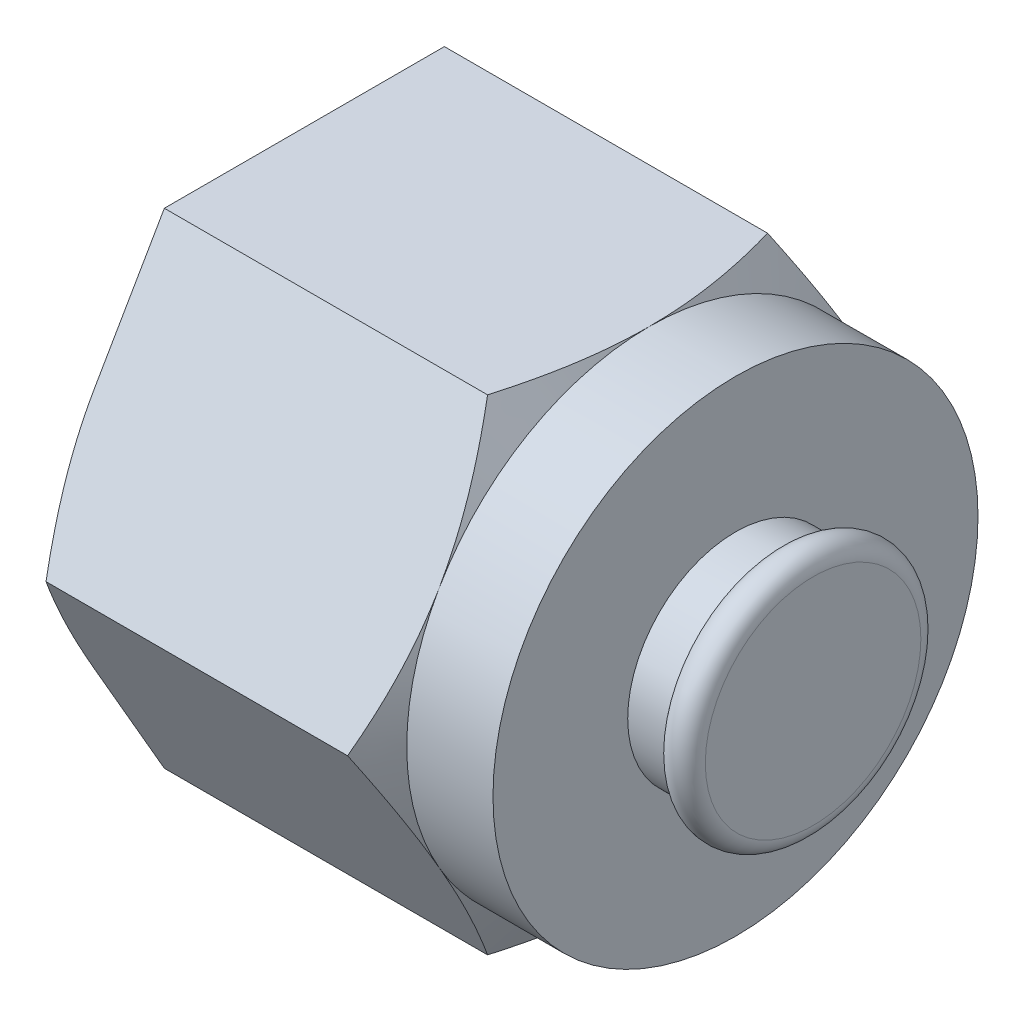
ISO-10303-21;
HEADER;
FILE_DESCRIPTION(('STEP AP214'),'2;1');
FILE_NAME('part.step','',(''),(''),'','','');
FILE_SCHEMA(('AUTOMOTIVE_DESIGN { 1 0 10303 214 1 1 1 1 }'));
ENDSEC;
DATA;
#1=APPLICATION_CONTEXT('core data for automotive mechanical design processes');
#2=APPLICATION_PROTOCOL_DEFINITION('international standard','automotive_design',2000,#1);
#3=PRODUCT_CONTEXT('',#1,'mechanical');
#4=PRODUCT('Part','Part','',(#3));
#5=PRODUCT_RELATED_PRODUCT_CATEGORY('part','',(#4));
#6=PRODUCT_DEFINITION_FORMATION('','',#4);
#7=PRODUCT_DEFINITION_CONTEXT('part definition',#1,'design');
#8=PRODUCT_DEFINITION('design','',#6,#7);
#9=PRODUCT_DEFINITION_SHAPE('','',#8);
#10=(LENGTH_UNIT() NAMED_UNIT(*) SI_UNIT(.MILLI.,.METRE.));
#11=(NAMED_UNIT(*) PLANE_ANGLE_UNIT() SI_UNIT($,.RADIAN.));
#12=(NAMED_UNIT(*) SI_UNIT($,.STERADIAN.) SOLID_ANGLE_UNIT());
#13=UNCERTAINTY_MEASURE_WITH_UNIT(LENGTH_MEASURE(1.E-05),#10,'distance_accuracy_value','');
#14=(GEOMETRIC_REPRESENTATION_CONTEXT(3) GLOBAL_UNCERTAINTY_ASSIGNED_CONTEXT((#13)) GLOBAL_UNIT_ASSIGNED_CONTEXT((#10,
#11,#12)) REPRESENTATION_CONTEXT('',''));
#15=CARTESIAN_POINT('',(0.,0.,0.));
#16=DIRECTION('',(0.,0.,1.));
#17=DIRECTION('',(1.,0.,0.));
#18=AXIS2_PLACEMENT_3D('',#15,#16,#17);
#19=CARTESIAN_POINT('',(0.,0.,-3.571875));
#20=DIRECTION('',(-1.,0.,0.));
#21=DIRECTION('',(0.,-1.,0.));
#22=AXIS2_PLACEMENT_3D('',#19,#20,#21);
#23=PLANE('',#22);
#24=CARTESIAN_POINT('',(0.,0.,0.));
#25=DIRECTION('',(-1.,0.,0.));
#26=DIRECTION('',(0.,-1.,0.));
#27=AXIS2_PLACEMENT_3D('',#24,#25,#26);
#28=CIRCLE('',#27,5.55625000001091);
#29=CARTESIAN_POINT('',(0.,-5.55625000001091,0.));
#30=VERTEX_POINT('',#29);
#31=EDGE_CURVE('E13',#30,#30,#28,.F.);
#32=ORIENTED_EDGE('',*,*,#31,.T.);
#33=EDGE_LOOP('',(#32));
#34=FACE_BOUND('',#33,.T.);
#35=CARTESIAN_POINT('',(0.,0.,0.));
#36=DIRECTION('',(1.,0.,0.));
#37=DIRECTION('',(0.,0.,-1.));
#38=AXIS2_PLACEMENT_3D('',#35,#36,#37);
#39=CIRCLE('',#38,7.14375000000001);
#40=CARTESIAN_POINT('',(0.,-3.571875,-6.18666897828509));
#41=VERTEX_POINT('',#40);
#42=CARTESIAN_POINT('',(0.,3.57187500000001,-6.18666897828508));
#43=VERTEX_POINT('',#42);
#44=EDGE_CURVE('E245',#41,#43,#39,.T.);
#45=ORIENTED_EDGE('',*,*,#44,.F.);
#46=DIRECTION('',(0.,0.866025403784439,-0.5));
#47=VECTOR('',#46,1.);
#48=CARTESIAN_POINT('',(0.,-7.14375,-4.12444598552339));
#49=LINE('',#48,#47);
#50=CARTESIAN_POINT('',(0.,-7.14375,-4.12444598552339));
#51=VERTEX_POINT('',#50);
#52=EDGE_CURVE('E605',#41,#51,#49,.F.);
#53=ORIENTED_EDGE('',*,*,#52,.T.);
#54=DIRECTION('',(0.,0.,-1.));
#55=VECTOR('',#54,1.);
#56=CARTESIAN_POINT('',(0.,-7.14375,0.));
#57=LINE('',#56,#55);
#58=CARTESIAN_POINT('',(0.,-7.14375,4.12444598552339));
#59=VERTEX_POINT('',#58);
#60=EDGE_CURVE('E520',#51,#59,#57,.F.);
#61=ORIENTED_EDGE('',*,*,#60,.T.);
#62=DIRECTION('',(0.,0.866025403784439,0.5));
#63=VECTOR('',#62,1.);
#64=CARTESIAN_POINT('',(0.,-5.11854224457127,5.29370022828509));
#65=LINE('',#64,#63);
#66=CARTESIAN_POINT('',(0.,-3.571875,6.18666897828509));
#67=VERTEX_POINT('',#66);
#68=EDGE_CURVE('E662',#67,#59,#65,.F.);
#69=ORIENTED_EDGE('',*,*,#68,.F.);
#70=CARTESIAN_POINT('',(0.,0.,0.));
#71=DIRECTION('',(1.,0.,0.));
#72=DIRECTION('',(0.,0.,-1.));
#73=AXIS2_PLACEMENT_3D('',#70,#71,#72);
#74=CIRCLE('',#73,7.14375);
#75=CARTESIAN_POINT('',(0.,3.571875,6.18666897828508));
#76=VERTEX_POINT('',#75);
#77=EDGE_CURVE('E252',#76,#67,#74,.T.);
#78=ORIENTED_EDGE('',*,*,#77,.F.);
#79=DIRECTION('',(0.,-0.866025403784439,0.5));
#80=VECTOR('',#79,1.);
#81=CARTESIAN_POINT('',(0.,7.14375,4.12444598552339));
#82=LINE('',#81,#80);
#83=CARTESIAN_POINT('',(0.,7.14375,4.12444598552339));
#84=VERTEX_POINT('',#83);
#85=EDGE_CURVE('E670',#76,#84,#82,.F.);
#86=ORIENTED_EDGE('',*,*,#85,.T.);
#87=DIRECTION('',(0.,0.,1.));
#88=VECTOR('',#87,1.);
#89=CARTESIAN_POINT('',(0.,7.14375,-4.12444598552339));
#90=LINE('',#89,#88);
#91=CARTESIAN_POINT('',(0.,7.14375,-4.12444598552338));
#92=VERTEX_POINT('',#91);
#93=EDGE_CURVE('E64',#84,#92,#90,.F.);
#94=ORIENTED_EDGE('',*,*,#93,.T.);
#95=DIRECTION('',(0.,-0.866025403784438,-0.500000000000001));
#96=VECTOR('',#95,1.);
#97=CARTESIAN_POINT('',(0.,2.02520775542873,-7.07963772828508));
#98=LINE('',#97,#96);
#99=EDGE_CURVE('E664',#43,#92,#98,.F.);
#100=ORIENTED_EDGE('',*,*,#99,.F.);
#101=EDGE_LOOP('',(#45,#53,#61,#69,#78,#86,#94,#100));
#102=FACE_BOUND('',#101,.T.);
#103=ADVANCED_FACE('F49',(#34,#102),#23,.T.);
#104=CARTESIAN_POINT('',(0.641882338563469,0.,0.));
#105=DIRECTION('',(1.,0.,0.));
#106=DIRECTION('',(0.,0.,-1.));
#107=AXIS2_PLACEMENT_3D('',#104,#105,#106);
#108=CONICAL_SURFACE('',#107,8.25552282287306,1.0471975511966);
#109=ORIENTED_EDGE('',*,*,#77,.T.);
#110=CARTESIAN_POINT('',(0.63805401447661,0.,8.24889197104678));
#111=CARTESIAN_POINT('',(0.541113333006277,-0.290749103113392,8.08102789809762));
#112=CARTESIAN_POINT('',(0.452298744118897,-0.583826629526697,7.91181950932947));
#113=CARTESIAN_POINT('',(0.295675815707458,-1.17256513177337,7.57191117657506));
#114=CARTESIAN_POINT('',(0.227763604848826,-1.46820557187686,7.40122308889797));
#115=CARTESIAN_POINT('',(0.144378939918105,-1.91445636028427,7.14358007608487));
#116=CARTESIAN_POINT('',(0.119654537854725,-2.0637703333272,7.05737361355476));
#117=CARTESIAN_POINT('',(0.0768560824914717,-2.36311310626514,6.88454798301907));
#118=CARTESIAN_POINT('',(0.0587818541539703,-2.51314188724056,6.79792882593672));
#119=CARTESIAN_POINT('',(0.0296013101259706,-2.81446921393709,6.62395741275429));
#120=CARTESIAN_POINT('',(0.0185304292394353,-2.96577035307854,6.53660365934228));
#121=CARTESIAN_POINT('',(0.00371445063233078,-3.26867019169915,6.36172435597717));
#122=CARTESIAN_POINT('',(-2.91962400463827E-05,-3.42026894416071,6.27419877543468));
#123=CARTESIAN_POINT('',(0.,-3.571875,6.18666897828508));
#124=B_SPLINE_CURVE_WITH_KNOTS('',3,(#110,#111,#112,#113,#114,#115,#116,#117,#118,#119,#120,
#121,#122,#123),.UNSPECIFIED.,.F.,.F.,(4,2,2,2,2,2,4),(0.,1.04875487567568,2.0922106828131,
2.61462320245386,3.1370219708162,3.66204321056615,4.18716839801106),.UNSPECIFIED.);
#125=CARTESIAN_POINT('',(0.63805401447661,0.,8.24889197104678));
#126=VERTEX_POINT('',#125);
#127=EDGE_CURVE('E399',#126,#67,#124,.T.);
#128=ORIENTED_EDGE('',*,*,#127,.F.);
#129=CARTESIAN_POINT('',(0.,3.571875,6.18666897828508));
#130=CARTESIAN_POINT('',(-2.91962400471701E-05,3.42026894416071,6.27419877543467));
#131=CARTESIAN_POINT('',(0.00371445063233008,3.26867019169915,6.36172435597717));
#132=CARTESIAN_POINT('',(0.0185304292394345,2.96577035307854,6.53660365934227));
#133=CARTESIAN_POINT('',(0.0296013101259697,2.81446921393709,6.62395741275429));
#134=CARTESIAN_POINT('',(0.058781854153969,2.51314188724056,6.79792882593672));
#135=CARTESIAN_POINT('',(0.0768560824914701,2.36311310626514,6.88454798301907));
#136=CARTESIAN_POINT('',(0.119654537854724,2.0637703333272,7.05737361355476));
#137=CARTESIAN_POINT('',(0.144378939918104,1.91445636028427,7.14358007608486));
#138=CARTESIAN_POINT('',(0.227763604848825,1.46820557187686,7.40122308889797));
#139=CARTESIAN_POINT('',(0.295675815707457,1.17256513177337,7.57191117657506));
#140=CARTESIAN_POINT('',(0.452298744118895,0.583826629526697,7.91181950932947));
#141=CARTESIAN_POINT('',(0.541113333006274,0.290749103113392,8.08102789809762));
#142=CARTESIAN_POINT('',(0.638054014476609,0.,8.24889197104678));
#143=B_SPLINE_CURVE_WITH_KNOTS('',3,(#129,#130,#131,#132,#133,#134,#135,#136,#137,#138,#139,
#140,#141,#142),.UNSPECIFIED.,.F.,.F.,(4,2,2,2,2,2,4),(0.,0.525125187444911,1.05014642719486,
1.5725451955572,2.09495771519797,3.13841352233538,4.18716839801106),.UNSPECIFIED.);
#144=EDGE_CURVE('E251',#76,#126,#143,.T.);
#145=ORIENTED_EDGE('',*,*,#144,.F.);
#146=EDGE_LOOP('',(#109,#128,#145));
#147=FACE_BOUND('',#146,.T.);
#148=ADVANCED_FACE('F392',(#147),#108,.T.);
#149=CARTESIAN_POINT('',(0.64188233856347,0.,0.));
#150=DIRECTION('',(1.,0.,0.));
#151=DIRECTION('',(0.,0.,-1.));
#152=AXIS2_PLACEMENT_3D('',#149,#150,#151);
#153=CONICAL_SURFACE('',#152,8.25552282287306,1.0471975511966);
#154=CARTESIAN_POINT('',(0.,-3.571875,-6.18666897828508));
#155=CARTESIAN_POINT('',(-2.91962400506114E-05,-3.42026894416071,-6.27419877543467));
#156=CARTESIAN_POINT('',(0.00371445063232652,-3.26867019169915,-6.36172435597717));
#157=CARTESIAN_POINT('',(0.0185304292394309,-2.96577035307853,-6.53660365934228));
#158=CARTESIAN_POINT('',(0.029601310125966,-2.81446921393708,-6.62395741275429));
#159=CARTESIAN_POINT('',(0.0587818541539656,-2.51314188724056,-6.79792882593672));
#160=CARTESIAN_POINT('',(0.0768560824914671,-2.36311310626513,-6.88454798301907));
#161=CARTESIAN_POINT('',(0.119654537854721,-2.06377033332719,-7.05737361355476));
#162=CARTESIAN_POINT('',(0.144378939918101,-1.91445636028427,-7.14358007608486));
#163=CARTESIAN_POINT('',(0.227763604848821,-1.46820557187686,-7.40122308889797));
#164=CARTESIAN_POINT('',(0.295675815707454,-1.17256513177336,-7.57191117657506));
#165=CARTESIAN_POINT('',(0.452298744118892,-0.583826629526696,-7.91181950932947));
#166=CARTESIAN_POINT('',(0.541113333006272,-0.290749103113391,-8.08102789809762));
#167=CARTESIAN_POINT('',(0.638054014476605,0.,-8.24889197104678));
#168=B_SPLINE_CURVE_WITH_KNOTS('',3,(#154,#155,#156,#157,#158,#159,#160,#161,#162,#163,#164,
#165,#166,#167),.UNSPECIFIED.,.F.,.F.,(4,2,2,2,2,2,4),(0.,0.52512518744491,1.05014642719486,
1.5725451955572,2.09495771519796,3.13841352233538,4.18716839801106),.UNSPECIFIED.);
#169=CARTESIAN_POINT('',(0.638054014476605,0.,-8.24889197104678));
#170=VERTEX_POINT('',#169);
#171=EDGE_CURVE('E344',#41,#170,#168,.T.);
#172=ORIENTED_EDGE('',*,*,#171,.F.);
#173=ORIENTED_EDGE('',*,*,#44,.T.);
#174=CARTESIAN_POINT('',(0.638054014476608,0.,-8.24889197104678));
#175=CARTESIAN_POINT('',(0.541113333006273,0.290749103113391,-8.08102789809762));
#176=CARTESIAN_POINT('',(0.452298744118893,0.583826629526697,-7.91181950932947));
#177=CARTESIAN_POINT('',(0.295675815707454,1.17256513177337,-7.57191117657506));
#178=CARTESIAN_POINT('',(0.227763604848821,1.46820557187686,-7.40122308889796));
#179=CARTESIAN_POINT('',(0.144378939918101,1.91445636028427,-7.14358007608486));
#180=CARTESIAN_POINT('',(0.11965453785472,2.0637703333272,-7.05737361355475));
#181=CARTESIAN_POINT('',(0.0768560824914662,2.36311310626514,-6.88454798301906));
#182=CARTESIAN_POINT('',(0.0587818541539648,2.51314188724056,-6.79792882593671));
#183=CARTESIAN_POINT('',(0.0296013101259651,2.81446921393709,-6.62395741275428));
#184=CARTESIAN_POINT('',(0.0185304292394299,2.96577035307854,-6.53660365934227));
#185=CARTESIAN_POINT('',(0.0037144506323255,3.26867019169916,-6.36172435597716));
#186=CARTESIAN_POINT('',(-2.91962400516603E-05,3.42026894416072,-6.27419877543467));
#187=CARTESIAN_POINT('',(0.,3.57187500000001,-6.18666897828508));
#188=B_SPLINE_CURVE_WITH_KNOTS('',3,(#174,#175,#176,#177,#178,#179,#180,#181,#182,#183,#184,
#185,#186,#187),.UNSPECIFIED.,.F.,.F.,(4,2,2,2,2,2,4),(0.,1.04875487567568,2.0922106828131,
2.61462320245387,3.1370219708162,3.66204321056616,4.18716839801107),.UNSPECIFIED.);
#189=EDGE_CURVE('E318',#170,#43,#188,.T.);
#190=ORIENTED_EDGE('',*,*,#189,.F.);
#191=EDGE_LOOP('',(#172,#173,#190));
#192=FACE_BOUND('',#191,.T.);
#193=ADVANCED_FACE('F387',(#192),#153,.T.);
#194=CARTESIAN_POINT('',(10.16,7.14375,-4.12444598552339));
#195=DIRECTION('',(0.,1.,0.));
#196=DIRECTION('',(0.,0.,1.));
#197=AXIS2_PLACEMENT_3D('',#194,#195,#196);
#198=PLANE('',#197);
#199=CARTESIAN_POINT('',(9.52194596628507,7.14375,-4.1244460521669));
#200=CARTESIAN_POINT('',(9.61888665044033,7.14375,-3.78871790101697));
#201=CARTESIAN_POINT('',(9.7077012418879,7.14375,-3.45030111814583));
#202=CARTESIAN_POINT('',(9.86432417492876,7.14375,-2.77048444186371));
#203=CARTESIAN_POINT('',(9.93223638786139,7.14375,-2.42910826107249));
#204=CARTESIAN_POINT('',(10.0156210553989,7.14375,-1.91382222714671));
#205=CARTESIAN_POINT('',(10.0403454582479,7.14375,-1.74140929928856));
#206=CARTESIAN_POINT('',(10.0831439149839,7.14375,-1.39575803258391));
#207=CARTESIAN_POINT('',(10.1012181439083,7.14375,-1.22251971558386));
#208=CARTESIAN_POINT('',(10.1303986888916,7.14375,-0.874576883485447));
#209=CARTESIAN_POINT('',(10.1414695701446,7.14375,-0.699869373762995));
#210=CARTESIAN_POINT('',(10.1562855492439,7.14375,-0.350110761217853));
#211=CARTESIAN_POINT('',(10.160029196242,7.14375,-0.175059597216362));
#212=CARTESIAN_POINT('',(10.16,7.14375,0.));
#213=B_SPLINE_CURVE_WITH_KNOTS('',3,(#199,#200,#201,#202,#203,#204,#205,#206,#207,#208,#209,
#210,#211,#212),.UNSPECIFIED.,.F.,.F.,(4,2,2,2,2,2,4),(0.,1.04875489307345,2.09221071739816,
2.61462324567714,3.13702202267617,3.66204327116605,4.1871684673594),.UNSPECIFIED.);
#214=CARTESIAN_POINT('',(9.52194597590424,7.14375,-4.12444601884514));
#215=VERTEX_POINT('',#214);
#216=CARTESIAN_POINT('',(10.16,7.14375,0.));
#217=VERTEX_POINT('',#216);
#218=EDGE_CURVE('E335',#215,#217,#213,.T.);
#219=ORIENTED_EDGE('',*,*,#218,.F.);
#220=DIRECTION('',(1.,0.,0.));
#221=VECTOR('',#220,1.);
#222=CARTESIAN_POINT('',(10.16,7.14375,-4.12444598552338));
#223=LINE('',#222,#221);
#224=EDGE_CURVE('E69',#92,#215,#223,.T.);
#225=ORIENTED_EDGE('',*,*,#224,.F.);
#226=ORIENTED_EDGE('',*,*,#93,.F.);
#227=DIRECTION('',(1.,0.,0.));
#228=VECTOR('',#227,1.);
#229=CARTESIAN_POINT('',(10.16,7.14375,4.12444598552339));
#230=LINE('',#229,#228);
#231=CARTESIAN_POINT('',(9.52194597590423,7.14375002885749,4.12444596886251));
#232=VERTEX_POINT('',#231);
#233=EDGE_CURVE('E521',#232,#84,#230,.F.);
#234=ORIENTED_EDGE('',*,*,#233,.F.);
#235=CARTESIAN_POINT('',(10.16,7.14375,0.));
#236=CARTESIAN_POINT('',(10.1600291962373,7.14375,0.175059590056039));
#237=CARTESIAN_POINT('',(10.1562855495477,7.14375,0.350110746898864));
#238=CARTESIAN_POINT('',(10.1414695716566,7.14375,0.699869345171053));
#239=CARTESIAN_POINT('',(10.130398691303,7.14375,0.874576847779202));
#240=CARTESIAN_POINT('',(10.1012181486645,7.14375,1.22251966580439));
#241=CARTESIAN_POINT('',(10.0831439211808,7.14375,1.395757975845));
#242=CARTESIAN_POINT('',(10.0403454678141,7.14375,1.74140922872256));
#243=CARTESIAN_POINT('',(10.0156210668936,7.14375,1.91382214971308));
#244=CARTESIAN_POINT('',(9.93223640575445,7.14375,2.42910816326725));
#245=CARTESIAN_POINT('',(9.86432419791253,7.14375,2.77048433071305));
#246=CARTESIAN_POINT('',(9.70770127623475,7.14375,3.45030098055173));
#247=CARTESIAN_POINT('',(9.61888669107126,7.14375,3.78871775032832));
#248=CARTESIAN_POINT('',(9.52194601350624,7.14375,4.12444588858797));
#249=B_SPLINE_CURVE_WITH_KNOTS('',3,(#235,#236,#237,#238,#239,#240,#241,#242,#243,#244,#245,
#246,#247,#248),.UNSPECIFIED.,.F.,.F.,(4,2,2,2,2,2,4),(0.,0.525125174719986,1.05014640175739,
1.57254515755735,2.09495766463352,3.13841344677139,4.18716829714137),.UNSPECIFIED.);
#250=EDGE_CURVE('E374',#217,#232,#249,.T.);
#251=ORIENTED_EDGE('',*,*,#250,.F.);
#252=EDGE_LOOP('',(#219,#225,#226,#234,#251));
#253=FACE_BOUND('',#252,.T.);
#254=ADVANCED_FACE('F383',(#253),#198,.T.);
#255=CARTESIAN_POINT('',(10.16,7.14375,4.12444598552339));
#256=DIRECTION('',(0.,0.5,0.866025403784439));
#257=DIRECTION('',(0.,-0.866025403784439,0.5));
#258=AXIS2_PLACEMENT_3D('',#255,#256,#257);
#259=PLANE('',#258);
#260=CARTESIAN_POINT('',(9.52194596628507,7.14375005771498,4.12444595220163));
#261=CARTESIAN_POINT('',(9.61888665044033,6.85300095005355,4.2923100277766));
#262=CARTESIAN_POINT('',(9.7077012418879,6.55992341902014,4.46151841921217));
#263=CARTESIAN_POINT('',(9.86432417492876,5.97118490744353,4.80142675735323));
#264=CARTESIAN_POINT('',(9.93223638786139,5.67554446263142,4.97211484774884));
#265=CARTESIAN_POINT('',(10.0156210553989,5.22929366703637,5.22975786471173));
#266=CARTESIAN_POINT('',(10.0403454582479,5.07997969157035,5.3159643286408));
#267=CARTESIAN_POINT('',(10.0831439149839,4.78063691375385,5.48878996199313));
#268=CARTESIAN_POINT('',(10.1012181439083,4.63060813032295,5.57540912049315));
#269=CARTESIAN_POINT('',(10.1303986888916,4.32928079866102,5.74938053654236));
#270=CARTESIAN_POINT('',(10.1414695701446,4.17797965700946,5.83673429140358));
#271=CARTESIAN_POINT('',(10.1562855492439,3.87507981335297,6.01161359767616));
#272=CARTESIAN_POINT('',(10.160029196242,3.72348105836564,6.0991391796769));
#273=CARTESIAN_POINT('',(10.16,3.571875,6.18666897828508));
#274=B_SPLINE_CURVE_WITH_KNOTS('',3,(#260,#261,#262,#263,#264,#265,#266,#267,#268,#269,#270,
#271,#272,#273),.UNSPECIFIED.,.F.,.F.,(4,2,2,2,2,2,4),(0.,1.04875489307345,2.09221071739816,
2.61462324567714,3.13702202267616,3.66204327116605,4.1871684673594),.UNSPECIFIED.);
#275=CARTESIAN_POINT('',(10.16,3.571875,6.18666897828508));
#276=VERTEX_POINT('',#275);
#277=EDGE_CURVE('E367',#232,#276,#274,.T.);
#278=ORIENTED_EDGE('',*,*,#277,.F.);
#279=ORIENTED_EDGE('',*,*,#233,.T.);
#280=ORIENTED_EDGE('',*,*,#85,.F.);
#281=ORIENTED_EDGE('',*,*,#144,.T.);
#282=DIRECTION('',(1.,0.,0.));
#283=VECTOR('',#282,1.);
#284=CARTESIAN_POINT('',(10.16,0.,8.24889197104678));
#285=LINE('',#284,#283);
#286=CARTESIAN_POINT('',(9.52194598789119,-7.10337858318262E-09,8.24889196694564));
#287=VERTEX_POINT('',#286);
#288=EDGE_CURVE('E407',#287,#126,#285,.F.);
#289=ORIENTED_EDGE('',*,*,#288,.F.);
#290=CARTESIAN_POINT('',(10.16,3.571875,6.18666897828508));
#291=CARTESIAN_POINT('',(10.1600291962396,3.42026894478258,6.27419877507564));
#292=CARTESIAN_POINT('',(10.1562855493981,3.26867019294275,6.36172435525918));
#293=CARTESIAN_POINT('',(10.1414695709122,2.96577035556173,6.5366036579086));
#294=CARTESIAN_POINT('',(10.1303986901159,2.81446921703816,6.62395741096388));
#295=CARTESIAN_POINT('',(10.101218146323,2.51314189156389,6.79792882344064));
#296=CARTESIAN_POINT('',(10.08314391813,2.36311311119289,6.88454798017403));
#297=CARTESIAN_POINT('',(10.0403454631046,2.06377033945582,7.05737361001639));
#298=CARTESIAN_POINT('',(10.0156210612347,1.91445636700935,7.14358007220214));
#299=CARTESIAN_POINT('',(9.93223639694559,1.4682055803712,7.40122308399375));
#300=CARTESIAN_POINT('',(9.86432418659748,1.17256514142675,7.57191117100167));
#301=CARTESIAN_POINT('',(9.70770125932559,0.583826641476681,7.91181950243014));
#302=CARTESIAN_POINT('',(9.61888667106841,0.290749116200632,8.0810278905417));
#303=CARTESIAN_POINT('',(9.52194599025898,1.42067572428504E-08,8.2488919628445));
#304=B_SPLINE_CURVE_WITH_KNOTS('',3,(#290,#291,#292,#293,#294,#295,#296,#297,#298,#299,#300,
#301,#302,#303),.UNSPECIFIED.,.F.,.F.,(4,2,2,2,2,2,4),(0.,0.52512518529145,1.05014642289004,
1.57254518912642,2.09495770664086,3.13841350954756,4.18716838094071),.UNSPECIFIED.);
#305=EDGE_CURVE('E433',#276,#287,#304,.T.);
#306=ORIENTED_EDGE('',*,*,#305,.F.);
#307=EDGE_LOOP('',(#278,#279,#280,#281,#289,#306));
#308=FACE_BOUND('',#307,.T.);
#309=ADVANCED_FACE('F386',(#308),#259,.T.);
#310=CARTESIAN_POINT('',(10.16,0.,8.24889197104678));
#311=DIRECTION('',(0.,-0.5,0.866025403784439));
#312=DIRECTION('',(0.,-0.866025403784439,-0.5));
#313=AXIS2_PLACEMENT_3D('',#310,#311,#312);
#314=PLANE('',#313);
#315=ORIENTED_EDGE('',*,*,#288,.T.);
#316=ORIENTED_EDGE('',*,*,#127,.T.);
#317=ORIENTED_EDGE('',*,*,#68,.T.);
#318=DIRECTION('',(1.,0.,0.));
#319=VECTOR('',#318,1.);
#320=CARTESIAN_POINT('',(10.16,-7.14375,4.12444598552338));
#321=LINE('',#320,#319);
#322=CARTESIAN_POINT('',(9.52194599987815,-7.14375,4.12444593579708));
#323=VERTEX_POINT('',#322);
#324=EDGE_CURVE('E406',#323,#59,#321,.F.);
#325=ORIENTED_EDGE('',*,*,#324,.F.);
#326=CARTESIAN_POINT('',(10.16,-3.571875,6.18666897828508));
#327=CARTESIAN_POINT('',(10.160029196242,-3.72348105836564,6.0991391796769));
#328=CARTESIAN_POINT('',(10.1562855492439,-3.87507981335297,6.01161359767616));
#329=CARTESIAN_POINT('',(10.1414695701446,-4.17797965700946,5.83673429140359));
#330=CARTESIAN_POINT('',(10.1303986888916,-4.32928079866102,5.74938053654236));
#331=CARTESIAN_POINT('',(10.1012181439083,-4.63060813032295,5.57540912049315));
#332=CARTESIAN_POINT('',(10.0831439149839,-4.78063691375385,5.48878996199313));
#333=CARTESIAN_POINT('',(10.0403454582479,-5.07997969157035,5.31596432864081));
#334=CARTESIAN_POINT('',(10.0156210553988,-5.22929366703636,5.22975786471173));
#335=CARTESIAN_POINT('',(9.93223638786139,-5.67554446263142,4.97211484774884));
#336=CARTESIAN_POINT('',(9.86432417492876,-5.97118490744353,4.80142675735323));
#337=CARTESIAN_POINT('',(9.70770124188789,-6.55992341902014,4.46151841921217));
#338=CARTESIAN_POINT('',(9.61888665044033,-6.85300095005355,4.2923100277766));
#339=CARTESIAN_POINT('',(9.52194596628507,-7.14375005771497,4.12444595220164));
#340=B_SPLINE_CURVE_WITH_KNOTS('',3,(#326,#327,#328,#329,#330,#331,#332,#333,#334,#335,#336,
#337,#338,#339),.UNSPECIFIED.,.F.,.F.,(4,2,2,2,2,2,4),(0.,0.52512519619335,1.05014644468323,
1.57254522168226,2.09495774996123,3.13841357428595,4.18716846735939),.UNSPECIFIED.);
#341=CARTESIAN_POINT('',(10.16,-3.571875,6.18666897828508));
#342=VERTEX_POINT('',#341);
#343=EDGE_CURVE('E417',#342,#323,#340,.T.);
#344=ORIENTED_EDGE('',*,*,#343,.F.);
#345=CARTESIAN_POINT('',(9.52194599025898,-1.42067580212556E-08,8.2488919628445));
#346=CARTESIAN_POINT('',(9.61888667106841,-0.290749116200634,8.0810278905417));
#347=CARTESIAN_POINT('',(9.70770125932559,-0.583826641476683,7.91181950243014));
#348=CARTESIAN_POINT('',(9.86432418659748,-1.17256514142675,7.57191117100167));
#349=CARTESIAN_POINT('',(9.93223639694559,-1.4682055803712,7.40122308399376));
#350=CARTESIAN_POINT('',(10.0156210612347,-1.91445636700935,7.14358007220214));
#351=CARTESIAN_POINT('',(10.0403454631046,-2.06377033945582,7.0573736100164));
#352=CARTESIAN_POINT('',(10.08314391813,-2.36311311119289,6.88454798017403));
#353=CARTESIAN_POINT('',(10.101218146323,-2.51314189156389,6.79792882344065));
#354=CARTESIAN_POINT('',(10.1303986901159,-2.81446921703816,6.62395741096388));
#355=CARTESIAN_POINT('',(10.1414695709122,-2.96577035556173,6.5366036579086));
#356=CARTESIAN_POINT('',(10.1562855493981,-3.26867019294275,6.36172435525918));
#357=CARTESIAN_POINT('',(10.1600291962396,-3.42026894478258,6.27419877507564));
#358=CARTESIAN_POINT('',(10.16,-3.571875,6.18666897828508));
#359=B_SPLINE_CURVE_WITH_KNOTS('',3,(#345,#346,#347,#348,#349,#350,#351,#352,#353,#354,#355,
#356,#357,#358),.UNSPECIFIED.,.F.,.F.,(4,2,2,2,2,2,4),(0.,1.04875487139315,2.09221067429985,
2.61462319181429,3.13702195805067,3.66204319564926,4.18716838094071),.UNSPECIFIED.);
#360=EDGE_CURVE('E424',#287,#342,#359,.T.);
#361=ORIENTED_EDGE('',*,*,#360,.F.);
#362=EDGE_LOOP('',(#315,#316,#317,#325,#344,#361));
#363=FACE_BOUND('',#362,.T.);
#364=ADVANCED_FACE('F408',(#363),#314,.T.);
#365=CARTESIAN_POINT('',(10.16,-7.14375,0.));
#366=DIRECTION('',(0.,-1.,0.));
#367=DIRECTION('',(1.,0.,0.));
#368=AXIS2_PLACEMENT_3D('',#365,#366,#367);
#369=PLANE('',#368);
#370=ORIENTED_EDGE('',*,*,#324,.T.);
#371=ORIENTED_EDGE('',*,*,#60,.F.);
#372=DIRECTION('',(1.,0.,0.));
#373=VECTOR('',#372,1.);
#374=CARTESIAN_POINT('',(10.16,-7.14375,-4.12444598552339));
#375=LINE('',#374,#373);
#376=CARTESIAN_POINT('',(9.52194599987814,-7.14374995693576,-4.12444601038654));
#377=VERTEX_POINT('',#376);
#378=EDGE_CURVE('E336',#377,#51,#375,.F.);
#379=ORIENTED_EDGE('',*,*,#378,.F.);
#380=CARTESIAN_POINT('',(10.16,-7.14375,0.));
#381=CARTESIAN_POINT('',(10.160029196242,-7.14375,-0.175059597216363));
#382=CARTESIAN_POINT('',(10.1562855492439,-7.14375,-0.350110761217853));
#383=CARTESIAN_POINT('',(10.1414695701446,-7.14375,-0.699869373762993));
#384=CARTESIAN_POINT('',(10.1303986888916,-7.14375,-0.874576883485445));
#385=CARTESIAN_POINT('',(10.1012181439083,-7.14375,-1.22251971558386));
#386=CARTESIAN_POINT('',(10.0831439149839,-7.14375,-1.3957580325839));
#387=CARTESIAN_POINT('',(10.0403454582479,-7.14375,-1.74140929928856));
#388=CARTESIAN_POINT('',(10.0156210553988,-7.14375,-1.91382222714671));
#389=CARTESIAN_POINT('',(9.93223638786139,-7.14375,-2.42910826107248));
#390=CARTESIAN_POINT('',(9.86432417492876,-7.14375,-2.77048444186371));
#391=CARTESIAN_POINT('',(9.7077012418879,-7.14375,-3.45030111814582));
#392=CARTESIAN_POINT('',(9.61888665044033,-7.14375,-3.78871790101695));
#393=CARTESIAN_POINT('',(9.52194596628507,-7.14375,-4.12444605216689));
#394=B_SPLINE_CURVE_WITH_KNOTS('',3,(#380,#381,#382,#383,#384,#385,#386,#387,#388,#389,#390,
#391,#392,#393),.UNSPECIFIED.,.F.,.F.,(4,2,2,2,2,2,4),(0.,0.525125196193349,1.05014644468323,
1.57254522168226,2.09495774996123,3.13841357428594,4.18716846735938),.UNSPECIFIED.);
#395=CARTESIAN_POINT('',(10.16,-7.14375,0.));
#396=VERTEX_POINT('',#395);
#397=EDGE_CURVE('E285',#396,#377,#394,.T.);
#398=ORIENTED_EDGE('',*,*,#397,.F.);
#399=CARTESIAN_POINT('',(9.52194602295274,-7.14375001442874,4.12444588858798));
#400=CARTESIAN_POINT('',(9.61888669467674,-7.14375000504003,3.78871774912988));
#401=CARTESIAN_POINT('',(9.70770127745904,-7.14375000131732,3.45030097905797));
#402=CARTESIAN_POINT('',(9.86432419735932,-7.14374999868934,2.77048432931372));
#403=CARTESIAN_POINT('',(9.93223640578483,-7.14374999975982,2.4291081622526));
#404=CARTESIAN_POINT('',(10.0156210670736,-7.14375000012025,1.91382214901466));
#405=CARTESIAN_POINT('',(10.0403454679258,-7.14375000003238,1.74140922805167));
#406=CARTESIAN_POINT('',(10.0831439212277,-7.14374999996762,1.39575797523519));
#407=CARTESIAN_POINT('',(10.1012181487145,-7.14374999999073,1.22251966522808));
#408=CARTESIAN_POINT('',(10.1303986913402,-7.14375000000932,0.874576847316088));
#409=CARTESIAN_POINT('',(10.1414695716799,-7.14375000000466,0.699869344787793));
#410=CARTESIAN_POINT('',(10.1562855495492,-7.14374999999534,0.350110746695823));
#411=CARTESIAN_POINT('',(10.1600291962315,-7.14374999999068,0.175059589953399));
#412=CARTESIAN_POINT('',(10.16,-7.14375,0.));
#413=B_SPLINE_CURVE_WITH_KNOTS('',3,(#399,#400,#401,#402,#403,#404,#405,#406,#407,#408,#409,
#410,#411,#412),.UNSPECIFIED.,.F.,.F.,(4,2,2,2,2,2,4),(0.,1.04875484942918,2.09221063089572,
2.61462313784252,3.13702189355009,3.66204312034432,4.18716829476093),.UNSPECIFIED.);
#414=EDGE_CURVE('E445',#323,#396,#413,.T.);
#415=ORIENTED_EDGE('',*,*,#414,.F.);
#416=EDGE_LOOP('',(#370,#371,#379,#398,#415));
#417=FACE_BOUND('',#416,.T.);
#418=ADVANCED_FACE('F309',(#417),#369,.T.);
#419=CARTESIAN_POINT('',(10.16,0.,-8.24889197104678));
#420=DIRECTION('',(0.,0.500000000000001,-0.866025403784438));
#421=DIRECTION('',(0.,0.866025403784438,0.500000000000001));
#422=AXIS2_PLACEMENT_3D('',#419,#420,#421);
#423=PLANE('',#422);
#424=CARTESIAN_POINT('',(9.52194602295274,9.11629024796267E-08,-8.24889193507473));
#425=CARTESIAN_POINT('',(9.61888669467674,0.290749184004546,-8.08102785721481));
#426=CARTESIAN_POINT('',(9.70770127745904,0.583826702092139,-7.9118194689549));
#427=CARTESIAN_POINT('',(9.86432419735932,1.1725651893723,-7.57191114180687));
#428=CARTESIAN_POINT('',(9.93223640578483,1.46820562282903,-7.40122305920338));
#429=CARTESIAN_POINT('',(10.0156210670736,1.9144564006881,-7.14358005289655));
#430=CARTESIAN_POINT('',(10.0403454679258,2.06377037013879,-7.05737359233896));
#431=CARTESIAN_POINT('',(10.0831439212277,2.3631131358954,-6.88454796587464));
#432=CARTESIAN_POINT('',(10.1012181487145,2.5131419132818,-6.7979288108911));
#433=CARTESIAN_POINT('',(10.1303986913402,2.81446923266722,-6.62395740195119));
#434=CARTESIAN_POINT('',(10.1414695716799,2.96577036808613,-6.53660365068301));
#435=CARTESIAN_POINT('',(10.1562855495492,3.26867019922115,-6.36172435162896));
#436=CARTESIAN_POINT('',(10.1600291962315,3.42026894791961,-6.27419877325371));
#437=CARTESIAN_POINT('',(10.16,3.571875,-6.18666897828508));
#438=B_SPLINE_CURVE_WITH_KNOTS('',3,(#424,#425,#426,#427,#428,#429,#430,#431,#432,#433,#434,
#435,#436,#437),.UNSPECIFIED.,.F.,.F.,(4,2,2,2,2,2,4),(0.,1.04875484942918,2.09221063089571,
2.61462313784252,3.13702189355008,3.66204312034432,4.18716829476093),.UNSPECIFIED.);
#439=CARTESIAN_POINT('',(9.52194599987814,4.30642457768221E-08,-8.24889194618362));
#440=VERTEX_POINT('',#439);
#441=CARTESIAN_POINT('',(10.16,3.571875,-6.18666897828508));
#442=VERTEX_POINT('',#441);
#443=EDGE_CURVE('E272',#440,#442,#438,.T.);
#444=ORIENTED_EDGE('',*,*,#443,.F.);
#445=DIRECTION('',(1.,0.,0.));
#446=VECTOR('',#445,1.);
#447=CARTESIAN_POINT('',(10.16,0.,-8.24889197104678));
#448=LINE('',#447,#446);
#449=EDGE_CURVE('E488',#170,#440,#448,.T.);
#450=ORIENTED_EDGE('',*,*,#449,.F.);
#451=ORIENTED_EDGE('',*,*,#189,.T.);
#452=ORIENTED_EDGE('',*,*,#99,.T.);
#453=ORIENTED_EDGE('',*,*,#224,.T.);
#454=CARTESIAN_POINT('',(10.16,3.571875,-6.18666897828508));
#455=CARTESIAN_POINT('',(10.1600291962373,3.72348105216462,-6.09913918325706));
#456=CARTESIAN_POINT('',(10.1562855495477,3.87507980095236,-6.01161360483565));
#457=CARTESIAN_POINT('',(10.1414695716566,4.17797963224811,-5.83673430569955));
#458=CARTESIAN_POINT('',(10.130398691303,4.32928076773851,-5.74938055439548));
#459=CARTESIAN_POINT('',(10.1012181486645,4.63060808721267,-5.57540914538288));
#460=CARTESIAN_POINT('',(10.0831439211808,4.78063686461651,-5.48878999036258));
#461=CARTESIAN_POINT('',(10.0403454678141,5.07997963045841,-5.3159643639238));
#462=CARTESIAN_POINT('',(10.0156210668936,5.22929359997687,-5.22975790342854));
#463=CARTESIAN_POINT('',(9.93223640575445,5.67554437792959,-4.97211489665145));
#464=CARTESIAN_POINT('',(9.86432419791253,5.97118481118423,-4.80142681292855));
#465=CARTESIAN_POINT('',(9.70770127623475,6.55992329986016,-4.46151848800921));
#466=CARTESIAN_POINT('',(9.61888669107126,6.85300081955335,-4.29231010312092));
#467=CARTESIAN_POINT('',(9.52194601350624,7.14374991605146,-4.12444603399109));
#468=B_SPLINE_CURVE_WITH_KNOTS('',3,(#454,#455,#456,#457,#458,#459,#460,#461,#462,#463,#464,
#465,#466,#467),.UNSPECIFIED.,.F.,.F.,(4,2,2,2,2,2,4),(0.,0.525125174719988,1.0501464017574,
1.57254515755735,2.09495766463352,3.13841344677139,4.18716829714137),.UNSPECIFIED.);
#469=EDGE_CURVE('E326',#442,#215,#468,.T.);
#470=ORIENTED_EDGE('',*,*,#469,.F.);
#471=EDGE_LOOP('',(#444,#450,#451,#452,#453,#470));
#472=FACE_BOUND('',#471,.T.);
#473=ADVANCED_FACE('F305',(#472),#423,.T.);
#474=CARTESIAN_POINT('',(10.16,-7.14375,-4.12444598552339));
#475=DIRECTION('',(0.,-0.5,-0.866025403784439));
#476=DIRECTION('',(0.,0.866025403784439,-0.5));
#477=AXIS2_PLACEMENT_3D('',#474,#475,#476);
#478=PLANE('',#477);
#479=ORIENTED_EDGE('',*,*,#378,.T.);
#480=ORIENTED_EDGE('',*,*,#52,.F.);
#481=ORIENTED_EDGE('',*,*,#171,.T.);
#482=ORIENTED_EDGE('',*,*,#449,.T.);
#483=CARTESIAN_POINT('',(10.16,-3.57187499999999,-6.18666897828509));
#484=CARTESIAN_POINT('',(10.160029196242,-3.42026894163435,-6.27419877689327));
#485=CARTESIAN_POINT('',(10.1562855492439,-3.26867018664703,-6.36172435889401));
#486=CARTESIAN_POINT('',(10.1414695701446,-2.96577034299054,-6.53660366516658));
#487=CARTESIAN_POINT('',(10.1303986888916,-2.81446920133898,-6.62395742002781));
#488=CARTESIAN_POINT('',(10.1012181439083,-2.51314186967704,-6.79792883607702));
#489=CARTESIAN_POINT('',(10.0831439149839,-2.36311308624614,-6.88454799457704));
#490=CARTESIAN_POINT('',(10.0403454582479,-2.06377030842964,-7.05737362792936));
#491=CARTESIAN_POINT('',(10.0156210553988,-1.91445633296363,-7.14358009185844));
#492=CARTESIAN_POINT('',(9.93223638786139,-1.46820553736858,-7.40122310882133));
#493=CARTESIAN_POINT('',(9.86432417492876,-1.17256509255647,-7.57191119921694));
#494=CARTESIAN_POINT('',(9.7077012418879,-0.583826580979861,-7.91181953735799));
#495=CARTESIAN_POINT('',(9.61888665044033,-0.290749049946453,-8.08102792879356));
#496=CARTESIAN_POINT('',(9.52194596628507,5.77149732636792E-08,-8.24889200436853));
#497=B_SPLINE_CURVE_WITH_KNOTS('',3,(#483,#484,#485,#486,#487,#488,#489,#490,#491,#492,#493,
#494,#495,#496),.UNSPECIFIED.,.F.,.F.,(4,2,2,2,2,2,4),(0.,0.525125196193349,1.05014644468323,
1.57254522168226,2.09495774996123,3.13841357428594,4.18716846735939),.UNSPECIFIED.);
#498=CARTESIAN_POINT('',(10.16,-3.57187499999999,-6.18666897828509));
#499=VERTEX_POINT('',#498);
#500=EDGE_CURVE('E284',#499,#440,#497,.T.);
#501=ORIENTED_EDGE('',*,*,#500,.F.);
#502=CARTESIAN_POINT('',(9.52194602295274,-7.14374992326585,-4.12444604648674));
#503=CARTESIAN_POINT('',(9.61888669467673,-6.85300082103549,-4.29231010808493));
#504=CARTESIAN_POINT('',(9.70770127745904,-6.55992329922519,-4.46151848989693));
#505=CARTESIAN_POINT('',(9.86432419735932,-5.97118480931705,-4.80142681249315));
#506=CARTESIAN_POINT('',(9.93223640578483,-5.67554437693079,-4.97211489695078));
#507=CARTESIAN_POINT('',(10.0156210670736,-5.22929359943215,-5.22975790388189));
#508=CARTESIAN_POINT('',(10.0403454679258,-5.07997962989359,-5.31596436428729));
#509=CARTESIAN_POINT('',(10.0831439212277,-4.78063686407222,-5.48878999063945));
#510=CARTESIAN_POINT('',(10.1012181487145,-4.63060808670893,-5.57540914566301));
#511=CARTESIAN_POINT('',(10.1303986913402,-4.32928076734209,-5.74938055463511));
#512=CARTESIAN_POINT('',(10.1414695716799,-4.17797963191853,-5.83673430589522));
#513=CARTESIAN_POINT('',(10.1562855495492,-3.87507980077419,-6.01161360493314));
#514=CARTESIAN_POINT('',(10.1600291962315,-3.72348105207106,-6.09913918330031));
#515=CARTESIAN_POINT('',(10.16,-3.57187499999999,-6.18666897828509));
#516=B_SPLINE_CURVE_WITH_KNOTS('',3,(#502,#503,#504,#505,#506,#507,#508,#509,#510,#511,#512,
#513,#514,#515),.UNSPECIFIED.,.F.,.F.,(4,2,2,2,2,2,4),(0.,1.04875484942918,2.09221063089572,
2.61462313784253,3.1370218935501,3.66204312034433,4.18716829476094),.UNSPECIFIED.);
#517=EDGE_CURVE('E463',#377,#499,#516,.T.);
#518=ORIENTED_EDGE('',*,*,#517,.F.);
#519=EDGE_LOOP('',(#479,#480,#481,#482,#501,#518));
#520=FACE_BOUND('',#519,.T.);
#521=ADVANCED_FACE('F308',(#520),#478,.T.);
#522=CARTESIAN_POINT('',(9.51811766143653,0.,0.));
#523=DIRECTION('',(-1.,0.,0.));
#524=DIRECTION('',(0.,0.,1.));
#525=AXIS2_PLACEMENT_3D('',#522,#523,#524);
#526=CONICAL_SURFACE('',#525,8.25552282287306,1.0471975511966);
#527=ORIENTED_EDGE('',*,*,#218,.T.);
#528=CARTESIAN_POINT('',(10.16,0.,0.));
#529=DIRECTION('',(1.,0.,0.));
#530=DIRECTION('',(0.,1.,0.));
#531=AXIS2_PLACEMENT_3D('',#528,#529,#530);
#532=CIRCLE('',#531,7.14375);
#533=EDGE_CURVE('E478',#442,#217,#532,.T.);
#534=ORIENTED_EDGE('',*,*,#533,.F.);
#535=ORIENTED_EDGE('',*,*,#469,.T.);
#536=EDGE_LOOP('',(#527,#534,#535));
#537=FACE_BOUND('',#536,.T.);
#538=ADVANCED_FACE('F351',(#537),#526,.T.);
#539=CARTESIAN_POINT('',(9.51811766143653,0.,0.));
#540=DIRECTION('',(-1.,0.,0.));
#541=DIRECTION('',(0.,0.,1.));
#542=AXIS2_PLACEMENT_3D('',#539,#540,#541);
#543=CONICAL_SURFACE('',#542,8.25552282287306,1.0471975511966);
#544=ORIENTED_EDGE('',*,*,#277,.T.);
#545=CARTESIAN_POINT('',(10.16,0.,0.));
#546=DIRECTION('',(1.,0.,0.));
#547=DIRECTION('',(0.,1.,0.));
#548=AXIS2_PLACEMENT_3D('',#545,#546,#547);
#549=CIRCLE('',#548,7.14375);
#550=EDGE_CURVE('E483',#217,#276,#549,.T.);
#551=ORIENTED_EDGE('',*,*,#550,.F.);
#552=ORIENTED_EDGE('',*,*,#250,.T.);
#553=EDGE_LOOP('',(#544,#551,#552));
#554=FACE_BOUND('',#553,.T.);
#555=ADVANCED_FACE('F355',(#554),#543,.T.);
#556=CARTESIAN_POINT('',(9.51811766143653,0.,0.));
#557=DIRECTION('',(-1.,0.,0.));
#558=DIRECTION('',(0.,0.,1.));
#559=AXIS2_PLACEMENT_3D('',#556,#557,#558);
#560=CONICAL_SURFACE('',#559,8.25552282287306,1.0471975511966);
#561=CARTESIAN_POINT('',(10.16,0.,0.));
#562=DIRECTION('',(1.,0.,0.));
#563=DIRECTION('',(0.,1.,0.));
#564=AXIS2_PLACEMENT_3D('',#561,#562,#563);
#565=CIRCLE('',#564,7.14375);
#566=EDGE_CURVE('E230',#276,#342,#565,.T.);
#567=ORIENTED_EDGE('',*,*,#566,.F.);
#568=ORIENTED_EDGE('',*,*,#305,.T.);
#569=ORIENTED_EDGE('',*,*,#360,.T.);
#570=EDGE_LOOP('',(#567,#568,#569));
#571=FACE_BOUND('',#570,.T.);
#572=ADVANCED_FACE('F361',(#571),#560,.T.);
#573=CARTESIAN_POINT('',(9.51811766143654,0.,0.));
#574=DIRECTION('',(-1.,0.,0.));
#575=DIRECTION('',(0.,0.,1.));
#576=AXIS2_PLACEMENT_3D('',#573,#574,#575);
#577=CONICAL_SURFACE('',#576,8.25552282287306,1.0471975511966);
#578=CARTESIAN_POINT('',(10.16,0.,0.));
#579=DIRECTION('',(1.,0.,0.));
#580=DIRECTION('',(0.,1.,0.));
#581=AXIS2_PLACEMENT_3D('',#578,#579,#580);
#582=CIRCLE('',#581,7.14375);
#583=EDGE_CURVE('E498',#342,#396,#582,.T.);
#584=ORIENTED_EDGE('',*,*,#583,.F.);
#585=ORIENTED_EDGE('',*,*,#343,.T.);
#586=ORIENTED_EDGE('',*,*,#414,.T.);
#587=EDGE_LOOP('',(#584,#585,#586));
#588=FACE_BOUND('',#587,.T.);
#589=ADVANCED_FACE('F453',(#588),#577,.T.);
#590=CARTESIAN_POINT('',(9.51811766143654,0.,0.));
#591=DIRECTION('',(-1.,0.,0.));
#592=DIRECTION('',(0.,0.,1.));
#593=AXIS2_PLACEMENT_3D('',#590,#591,#592);
#594=CONICAL_SURFACE('',#593,8.25552282287306,1.0471975511966);
#595=CARTESIAN_POINT('',(10.16,0.,0.));
#596=DIRECTION('',(1.,0.,0.));
#597=DIRECTION('',(0.,1.,0.));
#598=AXIS2_PLACEMENT_3D('',#595,#596,#597);
#599=CIRCLE('',#598,7.14375);
#600=EDGE_CURVE('E492',#396,#499,#599,.T.);
#601=ORIENTED_EDGE('',*,*,#600,.F.);
#602=ORIENTED_EDGE('',*,*,#397,.T.);
#603=ORIENTED_EDGE('',*,*,#517,.T.);
#604=EDGE_LOOP('',(#601,#602,#603));
#605=FACE_BOUND('',#604,.T.);
#606=ADVANCED_FACE('F456',(#605),#594,.T.);
#607=CARTESIAN_POINT('',(9.51811766143654,0.,0.));
#608=DIRECTION('',(-1.,0.,0.));
#609=DIRECTION('',(0.,0.,1.));
#610=AXIS2_PLACEMENT_3D('',#607,#608,#609);
#611=CONICAL_SURFACE('',#610,8.25552282287306,1.0471975511966);
#612=CARTESIAN_POINT('',(10.16,0.,0.));
#613=DIRECTION('',(1.,0.,0.));
#614=DIRECTION('',(0.,1.,0.));
#615=AXIS2_PLACEMENT_3D('',#612,#613,#614);
#616=CIRCLE('',#615,7.14375);
#617=EDGE_CURVE('E497',#499,#442,#616,.T.);
#618=ORIENTED_EDGE('',*,*,#617,.F.);
#619=ORIENTED_EDGE('',*,*,#500,.T.);
#620=ORIENTED_EDGE('',*,*,#443,.T.);
#621=EDGE_LOOP('',(#618,#619,#620));
#622=FACE_BOUND('',#621,.T.);
#623=ADVANCED_FACE('F302',(#622),#611,.T.);
#624=CARTESIAN_POINT('',(11.43,0.,0.));
#625=DIRECTION('',(1.,0.,0.));
#626=DIRECTION('',(0.,1.,0.));
#627=AXIS2_PLACEMENT_3D('',#624,#625,#626);
#628=CYLINDRICAL_SURFACE('',#627,7.14375);
#629=CARTESIAN_POINT('',(12.7,0.,0.));
#630=DIRECTION('',(1.,0.,0.));
#631=DIRECTION('',(0.,1.,0.));
#632=AXIS2_PLACEMENT_3D('',#629,#630,#631);
#633=CIRCLE('',#632,7.14375);
#634=CARTESIAN_POINT('',(12.7,7.14375,0.));
#635=VERTEX_POINT('',#634);
#636=EDGE_CURVE('E515',#635,#635,#633,.T.);
#637=ORIENTED_EDGE('',*,*,#636,.F.);
#638=EDGE_LOOP('',(#637));
#639=FACE_BOUND('',#638,.T.);
#640=ORIENTED_EDGE('',*,*,#600,.T.);
#641=ORIENTED_EDGE('',*,*,#617,.T.);
#642=ORIENTED_EDGE('',*,*,#533,.T.);
#643=ORIENTED_EDGE('',*,*,#550,.T.);
#644=ORIENTED_EDGE('',*,*,#566,.T.);
#645=ORIENTED_EDGE('',*,*,#583,.T.);
#646=EDGE_LOOP('',(#640,#641,#642,#643,#644,#645));
#647=FACE_BOUND('',#646,.T.);
#648=ADVANCED_FACE('F614',(#639,#647),#628,.T.);
#649=CARTESIAN_POINT('',(12.7,0.,-3.571875));
#650=DIRECTION('',(1.,0.,0.));
#651=DIRECTION('',(0.,1.,0.));
#652=AXIS2_PLACEMENT_3D('',#649,#650,#651);
#653=PLANE('',#652);
#654=CARTESIAN_POINT('',(12.7,0.,0.));
#655=DIRECTION('',(1.,0.,0.));
#656=DIRECTION('',(0.,1.,0.));
#657=AXIS2_PLACEMENT_3D('',#654,#655,#656);
#658=CIRCLE('',#657,3.175);
#659=CARTESIAN_POINT('',(12.7,3.175,0.));
#660=VERTEX_POINT('',#659);
#661=EDGE_CURVE('E672',#660,#660,#658,.T.);
#662=ORIENTED_EDGE('',*,*,#661,.F.);
#663=EDGE_LOOP('',(#662));
#664=FACE_BOUND('',#663,.T.);
#665=ORIENTED_EDGE('',*,*,#636,.T.);
#666=EDGE_LOOP('',(#665));
#667=FACE_BOUND('',#666,.T.);
#668=ADVANCED_FACE('F689',(#664,#667),#653,.T.);
#669=CARTESIAN_POINT('',(11.557,0.,0.));
#670=DIRECTION('',(-1.,0.,0.));
#671=DIRECTION('',(0.,0.,1.));
#672=AXIS2_PLACEMENT_3D('',#669,#670,#671);
#673=CYLINDRICAL_SURFACE('',#672,3.175);
#674=ORIENTED_EDGE('',*,*,#661,.T.);
#675=EDGE_LOOP('',(#674));
#676=FACE_BOUND('',#675,.T.);
#677=CARTESIAN_POINT('',(13.97,0.,0.));
#678=DIRECTION('',(-1.,0.,0.));
#679=DIRECTION('',(0.,0.,1.));
#680=AXIS2_PLACEMENT_3D('',#677,#678,#679);
#681=CIRCLE('',#680,3.175);
#682=CARTESIAN_POINT('',(13.97,0.,3.175));
#683=VERTEX_POINT('',#682);
#684=EDGE_CURVE('E164',#683,#683,#681,.T.);
#685=ORIENTED_EDGE('',*,*,#684,.T.);
#686=EDGE_LOOP('',(#685));
#687=FACE_BOUND('',#686,.T.);
#688=ADVANCED_FACE('F691',(#676,#687),#673,.T.);
#689=CARTESIAN_POINT('',(14.478,0.,0.));
#690=DIRECTION('',(-1.,0.,0.));
#691=DIRECTION('',(0.,0.,1.));
#692=AXIS2_PLACEMENT_3D('',#689,#690,#691);
#693=TOROIDAL_SURFACE('',#692,3.175,0.508);
#694=CARTESIAN_POINT('',(14.986,0.,0.));
#695=DIRECTION('',(-1.,0.,0.));
#696=DIRECTION('',(0.,0.,-1.));
#697=AXIS2_PLACEMENT_3D('',#694,#695,#696);
#698=CIRCLE('',#697,3.175);
#699=CARTESIAN_POINT('',(14.986,0.,-3.175));
#700=VERTEX_POINT('',#699);
#701=CARTESIAN_POINT('',(14.986,0.,3.175));
#702=VERTEX_POINT('',#701);
#703=EDGE_CURVE('E168',#700,#702,#698,.T.);
#704=ORIENTED_EDGE('',*,*,#703,.T.);
#705=CARTESIAN_POINT('',(14.986,0.,0.));
#706=DIRECTION('',(-1.,0.,0.));
#707=DIRECTION('',(0.,0.,1.));
#708=AXIS2_PLACEMENT_3D('',#705,#706,#707);
#709=CIRCLE('',#708,3.175);
#710=EDGE_CURVE('E215',#702,#700,#709,.T.);
#711=ORIENTED_EDGE('',*,*,#710,.T.);
#712=EDGE_LOOP('',(#704,#711));
#713=FACE_BOUND('',#712,.T.);
#714=ORIENTED_EDGE('',*,*,#684,.F.);
#715=EDGE_LOOP('',(#714));
#716=FACE_BOUND('',#715,.T.);
#717=ADVANCED_FACE('F189',(#713,#716),#693,.T.);
#718=CARTESIAN_POINT('',(14.986,0.,-1.5875));
#719=DIRECTION('',(1.,0.,0.));
#720=DIRECTION('',(0.,0.,-1.));
#721=AXIS2_PLACEMENT_3D('',#718,#719,#720);
#722=PLANE('',#721);
#723=ORIENTED_EDGE('',*,*,#703,.F.);
#724=ORIENTED_EDGE('',*,*,#710,.F.);
#725=EDGE_LOOP('',(#723,#724));
#726=FACE_BOUND('',#725,.T.);
#727=ADVANCED_FACE('F178',(#726),#722,.T.);
#728=CARTESIAN_POINT('',(7.27329000008464,0.,0.));
#729=DIRECTION('',(1.,0.,0.));
#730=DIRECTION('',(0.,1.,0.));
#731=AXIS2_PLACEMENT_3D('',#728,#729,#730);
#732=CONICAL_SURFACE('',#731,4.57453999999186,0.785398163397449);
#733=CARTESIAN_POINT('',(8.2550000000765,0.,0.));
#734=DIRECTION('',(-1.,0.,0.));
#735=DIRECTION('',(0.,-1.,0.));
#736=AXIS2_PLACEMENT_3D('',#733,#734,#735);
#737=CIRCLE('',#736,5.55624999998372);
#738=CARTESIAN_POINT('',(8.2550000000765,-5.55624999998372,0.));
#739=VERTEX_POINT('',#738);
#740=EDGE_CURVE('E158',#739,#739,#737,.T.);
#741=ORIENTED_EDGE('',*,*,#740,.F.);
#742=EDGE_LOOP('',(#741));
#743=FACE_BOUND('',#742,.T.);
#744=CARTESIAN_POINT('',(7.27329000008464,0.,0.));
#745=DIRECTION('',(-1.,0.,0.));
#746=DIRECTION('',(0.,-1.,0.));
#747=AXIS2_PLACEMENT_3D('',#744,#745,#746);
#748=CIRCLE('',#747,4.57453999999186);
#749=CARTESIAN_POINT('',(7.27329000008464,-4.57453999999186,0.));
#750=VERTEX_POINT('',#749);
#751=EDGE_CURVE('E161',#750,#750,#748,.T.);
#752=ORIENTED_EDGE('',*,*,#751,.T.);
#753=EDGE_LOOP('',(#752));
#754=FACE_BOUND('',#753,.T.);
#755=ADVANCED_FACE('F188',(#743,#754),#732,.F.);
#756=CARTESIAN_POINT('',(8.2550000000765,0.,0.));
#757=DIRECTION('',(-1.,0.,0.));
#758=DIRECTION('',(0.,-1.,0.));
#759=AXIS2_PLACEMENT_3D('',#756,#757,#758);
#760=CYLINDRICAL_SURFACE('',#759,4.57453999999186);
#761=CARTESIAN_POINT('',(0.981710000019044,0.,0.));
#762=DIRECTION('',(-1.,0.,0.));
#763=DIRECTION('',(0.,0.,1.));
#764=AXIS2_PLACEMENT_3D('',#761,#762,#763);
#765=CIRCLE('',#764,4.57453999999186);
#766=CARTESIAN_POINT('',(0.981710000019045,0.,4.57453999999186));
#767=VERTEX_POINT('',#766);
#768=EDGE_CURVE('E57',#767,#767,#765,.T.);
#769=ORIENTED_EDGE('',*,*,#768,.T.);
#770=EDGE_LOOP('',(#769));
#771=FACE_BOUND('',#770,.T.);
#772=ORIENTED_EDGE('',*,*,#751,.F.);
#773=EDGE_LOOP('',(#772));
#774=FACE_BOUND('',#773,.T.);
#775=ADVANCED_FACE('F678',(#771,#774),#760,.F.);
#776=CARTESIAN_POINT('',(8.2550000000765,5.55624999998372,0.));
#777=DIRECTION('',(1.,0.,0.));
#778=DIRECTION('',(0.,1.,0.));
#779=AXIS2_PLACEMENT_3D('',#776,#777,#778);
#780=PLANE('',#779);
#781=CARTESIAN_POINT('',(8.255,0.,0.));
#782=DIRECTION('',(-1.,0.,0.));
#783=DIRECTION('',(0.,0.,1.));
#784=AXIS2_PLACEMENT_3D('',#781,#782,#783);
#785=CIRCLE('',#784,4.62915235010014);
#786=CARTESIAN_POINT('',(8.255,0.,4.62915235010014));
#787=VERTEX_POINT('',#786);
#788=EDGE_CURVE('E151',#787,#787,#785,.T.);
#789=ORIENTED_EDGE('',*,*,#788,.F.);
#790=EDGE_LOOP('',(#789));
#791=FACE_BOUND('',#790,.T.);
#792=ORIENTED_EDGE('',*,*,#740,.T.);
#793=EDGE_LOOP('',(#792));
#794=FACE_BOUND('',#793,.T.);
#795=ADVANCED_FACE('F837',(#791,#794),#780,.F.);
#796=CARTESIAN_POINT('',(3.30200000001924,0.,0.));
#797=DIRECTION('',(1.,0.,0.));
#798=DIRECTION('',(0.,0.,-1.));
#799=AXIS2_PLACEMENT_3D('',#796,#797,#798);
#800=CONICAL_SURFACE('',#799,3.30200000001923,0.261799387794386);
#801=ORIENTED_EDGE('',*,*,#788,.T.);
#802=EDGE_LOOP('',(#801));
#803=FACE_BOUND('',#802,.T.);
#804=CARTESIAN_POINT('',(3.30200000001924,0.,0.));
#805=DIRECTION('',(-1.,0.,0.));
#806=DIRECTION('',(0.,0.,1.));
#807=AXIS2_PLACEMENT_3D('',#804,#805,#806);
#808=CIRCLE('',#807,3.30200000001923);
#809=CARTESIAN_POINT('',(3.30200000001924,0.,3.30200000001923));
#810=VERTEX_POINT('',#809);
#811=EDGE_CURVE('E147',#810,#810,#808,.T.);
#812=ORIENTED_EDGE('',*,*,#811,.F.);
#813=EDGE_LOOP('',(#812));
#814=FACE_BOUND('',#813,.T.);
#815=ADVANCED_FACE('F842',(#803,#814),#800,.T.);
#816=CARTESIAN_POINT('',(3.30200000001924,0.,0.));
#817=DIRECTION('',(-1.,0.,0.));
#818=DIRECTION('',(0.,0.,1.));
#819=AXIS2_PLACEMENT_3D('',#816,#817,#818);
#820=PLANE('',#819);
#821=CARTESIAN_POINT('',(3.30200000001923,0.,0.));
#822=DIRECTION('',(-1.,0.,0.));
#823=DIRECTION('',(0.,0.,1.));
#824=AXIS2_PLACEMENT_3D('',#821,#822,#823);
#825=CIRCLE('',#824,2.413);
#826=CARTESIAN_POINT('',(3.30200000001923,0.,2.413));
#827=VERTEX_POINT('',#826);
#828=EDGE_CURVE('E148',#827,#827,#825,.T.);
#829=ORIENTED_EDGE('',*,*,#828,.F.);
#830=EDGE_LOOP('',(#829));
#831=FACE_BOUND('',#830,.T.);
#832=ORIENTED_EDGE('',*,*,#811,.T.);
#833=EDGE_LOOP('',(#832));
#834=FACE_BOUND('',#833,.T.);
#835=ADVANCED_FACE('F141',(#831,#834),#820,.T.);
#836=CARTESIAN_POINT('',(8.12800000001923,0.,0.));
#837=DIRECTION('',(-1.,0.,0.));
#838=DIRECTION('',(0.,0.,1.));
#839=AXIS2_PLACEMENT_3D('',#836,#837,#838);
#840=CONICAL_SURFACE('',#839,2.413,1.09519076115727);
#841=CARTESIAN_POINT('',(9.37078687476527,0.,0.));
#842=VERTEX_POINT('',#841);
#843=VERTEX_LOOP('',#842);
#844=FACE_BOUND('',#843,.T.);
#845=CARTESIAN_POINT('',(8.12800000001923,0.,0.));
#846=DIRECTION('',(-1.,0.,0.));
#847=DIRECTION('',(0.,0.,1.));
#848=AXIS2_PLACEMENT_3D('',#845,#846,#847);
#849=CIRCLE('',#848,2.413);
#850=CARTESIAN_POINT('',(8.12800000001923,0.,2.413));
#851=VERTEX_POINT('',#850);
#852=EDGE_CURVE('E145',#851,#851,#849,.T.);
#853=ORIENTED_EDGE('',*,*,#852,.T.);
#854=EDGE_LOOP('',(#853));
#855=FACE_BOUND('',#854,.T.);
#856=ADVANCED_FACE('F137',(#844,#855),#840,.F.);
#857=CARTESIAN_POINT('',(3.30200000001924,0.,0.));
#858=DIRECTION('',(-1.,0.,0.));
#859=DIRECTION('',(0.,0.,1.));
#860=AXIS2_PLACEMENT_3D('',#857,#858,#859);
#861=CYLINDRICAL_SURFACE('',#860,2.413);
#862=ORIENTED_EDGE('',*,*,#852,.F.);
#863=EDGE_LOOP('',(#862));
#864=FACE_BOUND('',#863,.T.);
#865=ORIENTED_EDGE('',*,*,#828,.T.);
#866=EDGE_LOOP('',(#865));
#867=FACE_BOUND('',#866,.T.);
#868=ADVANCED_FACE('F140',(#864,#867),#861,.F.);
#869=CARTESIAN_POINT('',(0.981710000019045,0.,0.));
#870=DIRECTION('',(-1.,0.,0.));
#871=DIRECTION('',(0.,0.,1.));
#872=AXIS2_PLACEMENT_3D('',#869,#870,#871);
#873=CONICAL_SURFACE('',#872,4.57453999999186,0.785398163397453);
#874=ORIENTED_EDGE('',*,*,#31,.F.);
#875=EDGE_LOOP('',(#874));
#876=FACE_BOUND('',#875,.T.);
#877=ORIENTED_EDGE('',*,*,#768,.F.);
#878=EDGE_LOOP('',(#877));
#879=FACE_BOUND('',#878,.T.);
#880=ADVANCED_FACE('F51',(#876,#879),#873,.F.);
#881=CLOSED_SHELL('',(#103,#148,#193,#254,#309,#364,#418,#473,#521,#538,#555,#572,#589,#606,
#623,#648,#668,#688,#717,#727,#755,#775,#795,#815,#835,#856,#868,#880));
#882=CARTESIAN_POINT('',(11.557,0.,0.));
#883=DIRECTION('',(-1.,0.,0.));
#884=DIRECTION('',(0.,0.,1.));
#885=AXIS2_PLACEMENT_3D('',#882,#883,#884);
#886=CYLINDRICAL_SURFACE('',#885,3.175);
#887=CARTESIAN_POINT('',(9.144,0.,0.));
#888=DIRECTION('',(-1.,0.,0.));
#889=DIRECTION('',(0.,0.,1.));
#890=AXIS2_PLACEMENT_3D('',#887,#888,#889);
#891=CIRCLE('',#890,3.175);
#892=CARTESIAN_POINT('',(9.144,0.,3.175));
#893=VERTEX_POINT('',#892);
#894=EDGE_CURVE('E229',#893,#893,#891,.T.);
#895=ORIENTED_EDGE('',*,*,#894,.F.);
#896=EDGE_LOOP('',(#895));
#897=FACE_BOUND('',#896,.T.);
#898=CARTESIAN_POINT('',(9.84377000000336,0.,0.));
#899=DIRECTION('',(-1.,0.,0.));
#900=DIRECTION('',(0.,0.,1.));
#901=AXIS2_PLACEMENT_3D('',#898,#899,#900);
#902=CIRCLE('',#901,3.17499999999882);
#903=CARTESIAN_POINT('',(9.84377000000336,0.,3.17499999999882));
#904=VERTEX_POINT('',#903);
#905=EDGE_CURVE('E219',#904,#904,#902,.T.);
#906=ORIENTED_EDGE('',*,*,#905,.T.);
#907=EDGE_LOOP('',(#906));
#908=FACE_BOUND('',#907,.T.);
#909=ADVANCED_FACE('F703',(#897,#908),#886,.T.);
#910=CARTESIAN_POINT('',(9.14400000010573,0.,0.));
#911=DIRECTION('',(-1.,0.,0.));
#912=DIRECTION('',(0.,0.,1.));
#913=AXIS2_PLACEMENT_3D('',#910,#911,#912);
#914=CONICAL_SURFACE('',#913,4.57453999985091,1.10714871781034);
#915=CARTESIAN_POINT('',(9.14400000002047,0.,0.));
#916=DIRECTION('',(-1.,0.,0.));
#917=DIRECTION('',(0.,0.,1.));
#918=AXIS2_PLACEMENT_3D('',#915,#916,#917);
#919=CIRCLE('',#918,4.57454000002144);
#920=CARTESIAN_POINT('',(9.14400000002047,0.,4.57454000002144));
#921=VERTEX_POINT('',#920);
#922=EDGE_CURVE('E720',#921,#921,#919,.F.);
#923=ORIENTED_EDGE('',*,*,#922,.F.);
#924=EDGE_LOOP('',(#923));
#925=FACE_BOUND('',#924,.T.);
#926=ORIENTED_EDGE('',*,*,#905,.F.);
#927=EDGE_LOOP('',(#926));
#928=FACE_BOUND('',#927,.T.);
#929=ADVANCED_FACE('F705',(#925,#928),#914,.F.);
#930=CARTESIAN_POINT('',(9.144,0.,-3.937));
#931=DIRECTION('',(1.,0.,0.));
#932=DIRECTION('',(0.,0.,-1.));
#933=AXIS2_PLACEMENT_3D('',#930,#931,#932);
#934=PLANE('',#933);
#935=ORIENTED_EDGE('',*,*,#922,.T.);
#936=EDGE_LOOP('',(#935));
#937=FACE_BOUND('',#936,.T.);
#938=ORIENTED_EDGE('',*,*,#894,.T.);
#939=EDGE_LOOP('',(#938));
#940=FACE_BOUND('',#939,.T.);
#941=ADVANCED_FACE('F710',(#937,#940),#934,.T.);
#942=CLOSED_SHELL('',(#909,#929,#941));
#943=ORIENTED_CLOSED_SHELL('',*,#942,.T.);
#944=BREP_WITH_VOIDS('B2',#881,(#943));
#945=ADVANCED_BREP_SHAPE_REPRESENTATION('',(#18,#944),#14);
#946=SHAPE_DEFINITION_REPRESENTATION(#9,#945);
ENDSEC;
END-ISO-10303-21;
